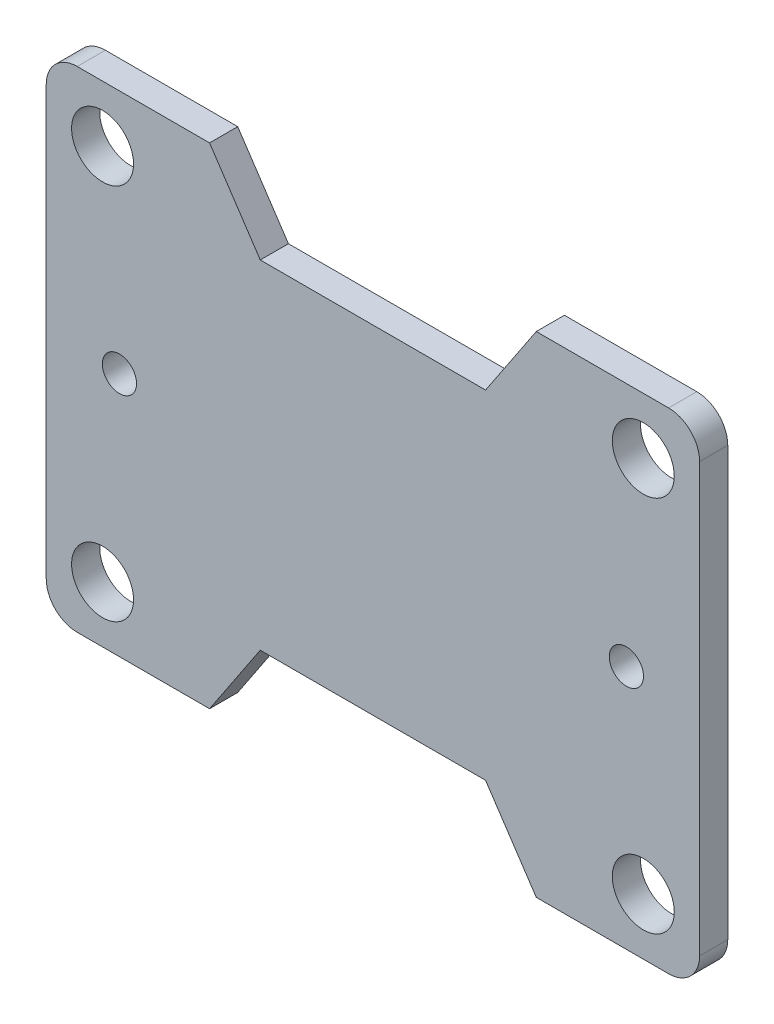
ISO-10303-21;
HEADER;
FILE_DESCRIPTION(('STEP AP214'),'2;1');
FILE_NAME('part.step','',(''),(''),'','','');
FILE_SCHEMA(('AUTOMOTIVE_DESIGN { 1 0 10303 214 1 1 1 1 }'));
ENDSEC;
DATA;
#1=APPLICATION_CONTEXT('core data for automotive mechanical design processes');
#2=APPLICATION_PROTOCOL_DEFINITION('international standard','automotive_design',2000,#1);
#3=PRODUCT_CONTEXT('',#1,'mechanical');
#4=PRODUCT('Part','Part','',(#3));
#5=PRODUCT_RELATED_PRODUCT_CATEGORY('part','',(#4));
#6=PRODUCT_DEFINITION_FORMATION('','',#4);
#7=PRODUCT_DEFINITION_CONTEXT('part definition',#1,'design');
#8=PRODUCT_DEFINITION('design','',#6,#7);
#9=PRODUCT_DEFINITION_SHAPE('','',#8);
#10=(LENGTH_UNIT() NAMED_UNIT(*) SI_UNIT(.MILLI.,.METRE.));
#11=(NAMED_UNIT(*) PLANE_ANGLE_UNIT() SI_UNIT($,.RADIAN.));
#12=(NAMED_UNIT(*) SI_UNIT($,.STERADIAN.) SOLID_ANGLE_UNIT());
#13=UNCERTAINTY_MEASURE_WITH_UNIT(LENGTH_MEASURE(1.E-05),#10,'distance_accuracy_value','');
#14=(GEOMETRIC_REPRESENTATION_CONTEXT(3) GLOBAL_UNCERTAINTY_ASSIGNED_CONTEXT((#13)) GLOBAL_UNIT_ASSIGNED_CONTEXT((#10,
#11,#12)) REPRESENTATION_CONTEXT('',''));
#15=CARTESIAN_POINT('',(0.,0.,0.));
#16=DIRECTION('',(0.,0.,1.));
#17=DIRECTION('',(1.,0.,0.));
#18=AXIS2_PLACEMENT_3D('',#15,#16,#17);
#19=CARTESIAN_POINT('',(53.,0.,2.5));
#20=DIRECTION('',(-1.,0.,0.));
#21=DIRECTION('',(0.,0.,1.));
#22=AXIS2_PLACEMENT_3D('',#19,#20,#21);
#23=PLANE('',#22);
#24=DIRECTION('',(0.,1.,0.));
#25=VECTOR('',#24,1.);
#26=CARTESIAN_POINT('',(53.,0.,0.));
#27=LINE('',#26,#25);
#28=CARTESIAN_POINT('',(53.,-2.25,0.));
#29=VERTEX_POINT('',#28);
#30=CARTESIAN_POINT('',(53.,35.75,0.));
#31=VERTEX_POINT('',#30);
#32=EDGE_CURVE('E222',#29,#31,#27,.T.);
#33=ORIENTED_EDGE('',*,*,#32,.T.);
#34=DIRECTION('',(0.,0.,-1.));
#35=VECTOR('',#34,1.);
#36=CARTESIAN_POINT('',(53.,35.75,2.5));
#37=LINE('',#36,#35);
#38=CARTESIAN_POINT('',(53.,35.75,2.5));
#39=VERTEX_POINT('',#38);
#40=EDGE_CURVE('E296',#31,#39,#37,.F.);
#41=ORIENTED_EDGE('',*,*,#40,.T.);
#42=DIRECTION('',(0.,1.,0.));
#43=VECTOR('',#42,1.);
#44=CARTESIAN_POINT('',(53.,0.,2.5));
#45=LINE('',#44,#43);
#46=CARTESIAN_POINT('',(53.,-2.25,2.5));
#47=VERTEX_POINT('',#46);
#48=EDGE_CURVE('E164',#47,#39,#45,.T.);
#49=ORIENTED_EDGE('',*,*,#48,.F.);
#50=DIRECTION('',(0.,0.,-1.));
#51=VECTOR('',#50,1.);
#52=CARTESIAN_POINT('',(53.,-2.25,2.5));
#53=LINE('',#52,#51);
#54=EDGE_CURVE('E293',#47,#29,#53,.T.);
#55=ORIENTED_EDGE('',*,*,#54,.T.);
#56=EDGE_LOOP('',(#33,#41,#49,#55));
#57=FACE_BOUND('',#56,.T.);
#58=ADVANCED_FACE('F37',(#57),#23,.F.);
#59=CARTESIAN_POINT('',(0.,38.5,2.5));
#60=DIRECTION('',(0.,-1.,0.));
#61=DIRECTION('',(0.,0.,-1.));
#62=AXIS2_PLACEMENT_3D('',#59,#60,#61);
#63=PLANE('',#62);
#64=DIRECTION('',(-1.,0.,0.));
#65=VECTOR('',#64,1.);
#66=CARTESIAN_POINT('',(0.,38.5,2.5));
#67=LINE('',#66,#65);
#68=CARTESIAN_POINT('',(50.25,38.5,2.5));
#69=VERTEX_POINT('',#68);
#70=CARTESIAN_POINT('',(38.5,38.5,2.5));
#71=VERTEX_POINT('',#70);
#72=EDGE_CURVE('E152',#69,#71,#67,.T.);
#73=ORIENTED_EDGE('',*,*,#72,.F.);
#74=DIRECTION('',(0.,0.,-1.));
#75=VECTOR('',#74,1.);
#76=CARTESIAN_POINT('',(50.25,38.5,2.5));
#77=LINE('',#76,#75);
#78=CARTESIAN_POINT('',(50.25,38.5,0.));
#79=VERTEX_POINT('',#78);
#80=EDGE_CURVE('E174',#69,#79,#77,.T.);
#81=ORIENTED_EDGE('',*,*,#80,.T.);
#82=DIRECTION('',(-1.,0.,0.));
#83=VECTOR('',#82,1.);
#84=CARTESIAN_POINT('',(0.,38.5,0.));
#85=LINE('',#84,#83);
#86=CARTESIAN_POINT('',(38.5,38.5,0.));
#87=VERTEX_POINT('',#86);
#88=EDGE_CURVE('E170',#79,#87,#85,.T.);
#89=ORIENTED_EDGE('',*,*,#88,.T.);
#90=DIRECTION('',(0.,0.,-1.));
#91=VECTOR('',#90,1.);
#92=CARTESIAN_POINT('',(38.5,38.5,2.5));
#93=LINE('',#92,#91);
#94=EDGE_CURVE('E167',#71,#87,#93,.T.);
#95=ORIENTED_EDGE('',*,*,#94,.F.);
#96=EDGE_LOOP('',(#73,#81,#89,#95));
#97=FACE_BOUND('',#96,.T.);
#98=ADVANCED_FACE('F168',(#97),#63,.F.);
#99=CARTESIAN_POINT('',(8.88461538461537,-5.92307692307692,2.5));
#100=DIRECTION('',(-0.832050294337844,0.554700196225229,0.));
#101=DIRECTION('',(-0.554700196225229,-0.832050294337844,0.));
#102=AXIS2_PLACEMENT_3D('',#99,#100,#101);
#103=PLANE('',#102);
#104=DIRECTION('',(0.554700196225229,0.832050294337844,0.));
#105=VECTOR('',#104,1.);
#106=CARTESIAN_POINT('',(8.88461538461537,-5.92307692307692,0.));
#107=LINE('',#106,#105);
#108=CARTESIAN_POINT('',(34.,31.75,0.));
#109=VERTEX_POINT('',#108);
#110=EDGE_CURVE('E226',#109,#87,#107,.T.);
#111=ORIENTED_EDGE('',*,*,#110,.F.);
#112=DIRECTION('',(0.,0.,-1.));
#113=VECTOR('',#112,1.);
#114=CARTESIAN_POINT('',(34.,31.75,2.5));
#115=LINE('',#114,#113);
#116=CARTESIAN_POINT('',(34.,31.75,2.5));
#117=VERTEX_POINT('',#116);
#118=EDGE_CURVE('E175',#117,#109,#115,.T.);
#119=ORIENTED_EDGE('',*,*,#118,.F.);
#120=DIRECTION('',(0.554700196225229,0.832050294337844,0.));
#121=VECTOR('',#120,1.);
#122=CARTESIAN_POINT('',(8.88461538461537,-5.92307692307692,2.5));
#123=LINE('',#122,#121);
#124=EDGE_CURVE('E158',#117,#71,#123,.T.);
#125=ORIENTED_EDGE('',*,*,#124,.T.);
#126=ORIENTED_EDGE('',*,*,#94,.T.);
#127=EDGE_LOOP('',(#111,#119,#125,#126));
#128=FACE_BOUND('',#127,.T.);
#129=ADVANCED_FACE('F177',(#128),#103,.T.);
#130=CARTESIAN_POINT('',(0.,31.75,2.5));
#131=DIRECTION('',(0.,-1.,0.));
#132=DIRECTION('',(0.,0.,-1.));
#133=AXIS2_PLACEMENT_3D('',#130,#131,#132);
#134=PLANE('',#133);
#135=DIRECTION('',(-1.,0.,0.));
#136=VECTOR('',#135,1.);
#137=CARTESIAN_POINT('',(0.,31.75,0.));
#138=LINE('',#137,#136);
#139=CARTESIAN_POINT('',(14.,31.75,0.));
#140=VERTEX_POINT('',#139);
#141=EDGE_CURVE('E228',#109,#140,#138,.T.);
#142=ORIENTED_EDGE('',*,*,#141,.T.);
#143=DIRECTION('',(0.,0.,-1.));
#144=VECTOR('',#143,1.);
#145=CARTESIAN_POINT('',(14.,31.75,2.5));
#146=LINE('',#145,#144);
#147=CARTESIAN_POINT('',(14.,31.75,2.5));
#148=VERTEX_POINT('',#147);
#149=EDGE_CURVE('E281',#148,#140,#146,.T.);
#150=ORIENTED_EDGE('',*,*,#149,.F.);
#151=DIRECTION('',(-1.,0.,0.));
#152=VECTOR('',#151,1.);
#153=CARTESIAN_POINT('',(0.,31.75,2.5));
#154=LINE('',#153,#152);
#155=EDGE_CURVE('E179',#117,#148,#154,.T.);
#156=ORIENTED_EDGE('',*,*,#155,.F.);
#157=ORIENTED_EDGE('',*,*,#118,.T.);
#158=EDGE_LOOP('',(#142,#150,#156,#157));
#159=FACE_BOUND('',#158,.T.);
#160=ADVANCED_FACE('F369',(#159),#134,.F.);
#161=CARTESIAN_POINT('',(24.3461538461538,16.2307692307693,2.5));
#162=DIRECTION('',(0.832050294337843,0.55470019622523,0.));
#163=DIRECTION('',(-0.55470019622523,0.832050294337843,0.));
#164=AXIS2_PLACEMENT_3D('',#161,#162,#163);
#165=PLANE('',#164);
#166=DIRECTION('',(0.55470019622523,-0.832050294337843,0.));
#167=VECTOR('',#166,1.);
#168=CARTESIAN_POINT('',(24.3461538461538,16.2307692307693,0.));
#169=LINE('',#168,#167);
#170=CARTESIAN_POINT('',(9.5,38.5,0.));
#171=VERTEX_POINT('',#170);
#172=EDGE_CURVE('E231',#171,#140,#169,.T.);
#173=ORIENTED_EDGE('',*,*,#172,.F.);
#174=DIRECTION('',(0.,0.,-1.));
#175=VECTOR('',#174,1.);
#176=CARTESIAN_POINT('',(9.5,38.5,2.5));
#177=LINE('',#176,#175);
#178=CARTESIAN_POINT('',(9.5,38.5,2.5));
#179=VERTEX_POINT('',#178);
#180=EDGE_CURVE('E278',#179,#171,#177,.T.);
#181=ORIENTED_EDGE('',*,*,#180,.F.);
#182=DIRECTION('',(0.55470019622523,-0.832050294337843,0.));
#183=VECTOR('',#182,1.);
#184=CARTESIAN_POINT('',(24.3461538461538,16.2307692307693,2.5));
#185=LINE('',#184,#183);
#186=EDGE_CURVE('E181',#179,#148,#185,.T.);
#187=ORIENTED_EDGE('',*,*,#186,.T.);
#188=ORIENTED_EDGE('',*,*,#149,.T.);
#189=EDGE_LOOP('',(#173,#181,#187,#188));
#190=FACE_BOUND('',#189,.T.);
#191=ADVANCED_FACE('F372',(#190),#165,.T.);
#192=CARTESIAN_POINT('',(0.,38.5,2.5));
#193=DIRECTION('',(0.,1.,0.));
#194=DIRECTION('',(0.,0.,1.));
#195=AXIS2_PLACEMENT_3D('',#192,#193,#194);
#196=PLANE('',#195);
#197=DIRECTION('',(1.,0.,0.));
#198=VECTOR('',#197,1.);
#199=CARTESIAN_POINT('',(0.,38.5,0.));
#200=LINE('',#199,#198);
#201=CARTESIAN_POINT('',(-2.25,38.5,0.));
#202=VERTEX_POINT('',#201);
#203=EDGE_CURVE('E234',#202,#171,#200,.T.);
#204=ORIENTED_EDGE('',*,*,#203,.F.);
#205=DIRECTION('',(0.,0.,-1.));
#206=VECTOR('',#205,1.);
#207=CARTESIAN_POINT('',(-2.25,38.5,2.5));
#208=LINE('',#207,#206);
#209=CARTESIAN_POINT('',(-2.25,38.5,2.5));
#210=VERTEX_POINT('',#209);
#211=EDGE_CURVE('E11',#202,#210,#208,.F.);
#212=ORIENTED_EDGE('',*,*,#211,.T.);
#213=DIRECTION('',(1.,0.,0.));
#214=VECTOR('',#213,1.);
#215=CARTESIAN_POINT('',(0.,38.5,2.5));
#216=LINE('',#215,#214);
#217=EDGE_CURVE('E187',#210,#179,#216,.T.);
#218=ORIENTED_EDGE('',*,*,#217,.T.);
#219=ORIENTED_EDGE('',*,*,#180,.T.);
#220=EDGE_LOOP('',(#204,#212,#218,#219));
#221=FACE_BOUND('',#220,.T.);
#222=ADVANCED_FACE('F376',(#221),#196,.T.);
#223=CARTESIAN_POINT('',(-5.,0.,2.5));
#224=DIRECTION('',(-1.,0.,0.));
#225=DIRECTION('',(0.,0.,1.));
#226=AXIS2_PLACEMENT_3D('',#223,#224,#225);
#227=PLANE('',#226);
#228=DIRECTION('',(0.,1.,0.));
#229=VECTOR('',#228,1.);
#230=CARTESIAN_POINT('',(-5.,0.,0.));
#231=LINE('',#230,#229);
#232=CARTESIAN_POINT('',(-5.,-2.25,0.));
#233=VERTEX_POINT('',#232);
#234=CARTESIAN_POINT('',(-5.,35.75,0.));
#235=VERTEX_POINT('',#234);
#236=EDGE_CURVE('E236',#233,#235,#231,.T.);
#237=ORIENTED_EDGE('',*,*,#236,.F.);
#238=DIRECTION('',(0.,0.,-1.));
#239=VECTOR('',#238,1.);
#240=CARTESIAN_POINT('',(-5.,-2.25,2.5));
#241=LINE('',#240,#239);
#242=CARTESIAN_POINT('',(-5.,-2.25,2.5));
#243=VERTEX_POINT('',#242);
#244=EDGE_CURVE('E45',#233,#243,#241,.F.);
#245=ORIENTED_EDGE('',*,*,#244,.T.);
#246=DIRECTION('',(0.,1.,0.));
#247=VECTOR('',#246,1.);
#248=CARTESIAN_POINT('',(-5.,0.,2.5));
#249=LINE('',#248,#247);
#250=CARTESIAN_POINT('',(-5.,35.75,2.5));
#251=VERTEX_POINT('',#250);
#252=EDGE_CURVE('E189',#243,#251,#249,.T.);
#253=ORIENTED_EDGE('',*,*,#252,.T.);
#254=DIRECTION('',(0.,0.,-1.));
#255=VECTOR('',#254,1.);
#256=CARTESIAN_POINT('',(-5.,35.75,2.5));
#257=LINE('',#256,#255);
#258=EDGE_CURVE('E308',#251,#235,#257,.T.);
#259=ORIENTED_EDGE('',*,*,#258,.T.);
#260=EDGE_LOOP('',(#237,#245,#253,#259));
#261=FACE_BOUND('',#260,.T.);
#262=ADVANCED_FACE('F313',(#261),#227,.T.);
#263=CARTESIAN_POINT('',(0.,-5.,2.5));
#264=DIRECTION('',(0.,-1.,0.));
#265=DIRECTION('',(0.,0.,-1.));
#266=AXIS2_PLACEMENT_3D('',#263,#264,#265);
#267=PLANE('',#266);
#268=DIRECTION('',(-1.,0.,0.));
#269=VECTOR('',#268,1.);
#270=CARTESIAN_POINT('',(0.,-5.,2.5));
#271=LINE('',#270,#269);
#272=CARTESIAN_POINT('',(9.5,-5.,2.5));
#273=VERTEX_POINT('',#272);
#274=CARTESIAN_POINT('',(-2.25,-5.,2.5));
#275=VERTEX_POINT('',#274);
#276=EDGE_CURVE('E192',#273,#275,#271,.T.);
#277=ORIENTED_EDGE('',*,*,#276,.T.);
#278=DIRECTION('',(0.,0.,-1.));
#279=VECTOR('',#278,1.);
#280=CARTESIAN_POINT('',(-2.25,-5.,2.5));
#281=LINE('',#280,#279);
#282=CARTESIAN_POINT('',(-2.25,-5.,0.));
#283=VERTEX_POINT('',#282);
#284=EDGE_CURVE('E305',#275,#283,#281,.T.);
#285=ORIENTED_EDGE('',*,*,#284,.T.);
#286=DIRECTION('',(-1.,0.,0.));
#287=VECTOR('',#286,1.);
#288=CARTESIAN_POINT('',(0.,-5.,0.));
#289=LINE('',#288,#287);
#290=CARTESIAN_POINT('',(9.5,-5.,0.));
#291=VERTEX_POINT('',#290);
#292=EDGE_CURVE('E239',#291,#283,#289,.T.);
#293=ORIENTED_EDGE('',*,*,#292,.F.);
#294=DIRECTION('',(0.,0.,-1.));
#295=VECTOR('',#294,1.);
#296=CARTESIAN_POINT('',(9.5,-5.,2.5));
#297=LINE('',#296,#295);
#298=EDGE_CURVE('E276',#273,#291,#297,.T.);
#299=ORIENTED_EDGE('',*,*,#298,.F.);
#300=EDGE_LOOP('',(#277,#285,#293,#299));
#301=FACE_BOUND('',#300,.T.);
#302=ADVANCED_FACE('F322',(#301),#267,.T.);
#303=CARTESIAN_POINT('',(8.88461538461539,-5.92307692307692,2.5));
#304=DIRECTION('',(-0.832050294337844,0.554700196225229,0.));
#305=DIRECTION('',(-0.554700196225229,-0.832050294337844,0.));
#306=AXIS2_PLACEMENT_3D('',#303,#304,#305);
#307=PLANE('',#306);
#308=DIRECTION('',(0.554700196225229,0.832050294337844,0.));
#309=VECTOR('',#308,1.);
#310=CARTESIAN_POINT('',(8.88461538461539,-5.92307692307692,0.));
#311=LINE('',#310,#309);
#312=CARTESIAN_POINT('',(14.,1.75,0.));
#313=VERTEX_POINT('',#312);
#314=EDGE_CURVE('E242',#291,#313,#311,.T.);
#315=ORIENTED_EDGE('',*,*,#314,.T.);
#316=DIRECTION('',(0.,0.,-1.));
#317=VECTOR('',#316,1.);
#318=CARTESIAN_POINT('',(14.,1.75,2.5));
#319=LINE('',#318,#317);
#320=CARTESIAN_POINT('',(14.,1.75,2.5));
#321=VERTEX_POINT('',#320);
#322=EDGE_CURVE('E274',#321,#313,#319,.T.);
#323=ORIENTED_EDGE('',*,*,#322,.F.);
#324=DIRECTION('',(0.554700196225229,0.832050294337844,0.));
#325=VECTOR('',#324,1.);
#326=CARTESIAN_POINT('',(8.88461538461539,-5.92307692307692,2.5));
#327=LINE('',#326,#325);
#328=EDGE_CURVE('E194',#273,#321,#327,.T.);
#329=ORIENTED_EDGE('',*,*,#328,.F.);
#330=ORIENTED_EDGE('',*,*,#298,.T.);
#331=EDGE_LOOP('',(#315,#323,#329,#330));
#332=FACE_BOUND('',#331,.T.);
#333=ADVANCED_FACE('F331',(#332),#307,.F.);
#334=CARTESIAN_POINT('',(0.,1.75,2.5));
#335=DIRECTION('',(0.,-1.,0.));
#336=DIRECTION('',(0.,0.,-1.));
#337=AXIS2_PLACEMENT_3D('',#334,#335,#336);
#338=PLANE('',#337);
#339=DIRECTION('',(-1.,0.,0.));
#340=VECTOR('',#339,1.);
#341=CARTESIAN_POINT('',(0.,1.75,0.));
#342=LINE('',#341,#340);
#343=CARTESIAN_POINT('',(34.,1.75,0.));
#344=VERTEX_POINT('',#343);
#345=EDGE_CURVE('E245',#344,#313,#342,.T.);
#346=ORIENTED_EDGE('',*,*,#345,.F.);
#347=DIRECTION('',(0.,0.,-1.));
#348=VECTOR('',#347,1.);
#349=CARTESIAN_POINT('',(34.,1.75,2.5));
#350=LINE('',#349,#348);
#351=CARTESIAN_POINT('',(34.,1.75,2.5));
#352=VERTEX_POINT('',#351);
#353=EDGE_CURVE('E272',#352,#344,#350,.T.);
#354=ORIENTED_EDGE('',*,*,#353,.F.);
#355=DIRECTION('',(-1.,0.,0.));
#356=VECTOR('',#355,1.);
#357=CARTESIAN_POINT('',(0.,1.75,2.5));
#358=LINE('',#357,#356);
#359=EDGE_CURVE('E196',#352,#321,#358,.T.);
#360=ORIENTED_EDGE('',*,*,#359,.T.);
#361=ORIENTED_EDGE('',*,*,#322,.T.);
#362=EDGE_LOOP('',(#346,#354,#360,#361));
#363=FACE_BOUND('',#362,.T.);
#364=ADVANCED_FACE('F337',(#363),#338,.T.);
#365=CARTESIAN_POINT('',(24.3461538461539,16.2307692307692,2.5));
#366=DIRECTION('',(0.832050294337844,0.554700196225229,0.));
#367=DIRECTION('',(-0.554700196225229,0.832050294337844,0.));
#368=AXIS2_PLACEMENT_3D('',#365,#366,#367);
#369=PLANE('',#368);
#370=DIRECTION('',(0.554700196225229,-0.832050294337844,0.));
#371=VECTOR('',#370,1.);
#372=CARTESIAN_POINT('',(24.3461538461539,16.2307692307692,0.));
#373=LINE('',#372,#371);
#374=CARTESIAN_POINT('',(38.5,-5.,0.));
#375=VERTEX_POINT('',#374);
#376=EDGE_CURVE('E248',#344,#375,#373,.T.);
#377=ORIENTED_EDGE('',*,*,#376,.T.);
#378=DIRECTION('',(0.,0.,-1.));
#379=VECTOR('',#378,1.);
#380=CARTESIAN_POINT('',(38.5,-5.,2.5));
#381=LINE('',#380,#379);
#382=CARTESIAN_POINT('',(38.5,-5.,2.5));
#383=VERTEX_POINT('',#382);
#384=EDGE_CURVE('E221',#383,#375,#381,.T.);
#385=ORIENTED_EDGE('',*,*,#384,.F.);
#386=DIRECTION('',(0.554700196225229,-0.832050294337844,0.));
#387=VECTOR('',#386,1.);
#388=CARTESIAN_POINT('',(24.3461538461539,16.2307692307692,2.5));
#389=LINE('',#388,#387);
#390=EDGE_CURVE('E199',#352,#383,#389,.T.);
#391=ORIENTED_EDGE('',*,*,#390,.F.);
#392=ORIENTED_EDGE('',*,*,#353,.T.);
#393=EDGE_LOOP('',(#377,#385,#391,#392));
#394=FACE_BOUND('',#393,.T.);
#395=ADVANCED_FACE('F339',(#394),#369,.F.);
#396=CARTESIAN_POINT('',(1.5,16.75,2.5));
#397=DIRECTION('',(0.,0.,-1.));
#398=DIRECTION('',(-1.,0.,0.));
#399=AXIS2_PLACEMENT_3D('',#396,#397,#398);
#400=CYLINDRICAL_SURFACE('',#399,1.52);
#401=CARTESIAN_POINT('',(1.5,16.75,2.5));
#402=DIRECTION('',(0.,0.,1.));
#403=DIRECTION('',(1.,0.,0.));
#404=AXIS2_PLACEMENT_3D('',#401,#402,#403);
#405=CIRCLE('',#404,1.52);
#406=CARTESIAN_POINT('',(3.02,16.75,2.5));
#407=VERTEX_POINT('',#406);
#408=EDGE_CURVE('E215',#407,#407,#405,.T.);
#409=ORIENTED_EDGE('',*,*,#408,.T.);
#410=EDGE_LOOP('',(#409));
#411=FACE_BOUND('',#410,.T.);
#412=CARTESIAN_POINT('',(1.5,16.75,0.));
#413=DIRECTION('',(0.,0.,1.));
#414=DIRECTION('',(1.,0.,0.));
#415=AXIS2_PLACEMENT_3D('',#412,#413,#414);
#416=CIRCLE('',#415,1.52);
#417=CARTESIAN_POINT('',(3.02,16.75,0.));
#418=VERTEX_POINT('',#417);
#419=EDGE_CURVE('E264',#418,#418,#416,.T.);
#420=ORIENTED_EDGE('',*,*,#419,.F.);
#421=EDGE_LOOP('',(#420));
#422=FACE_BOUND('',#421,.T.);
#423=ADVANCED_FACE('F391',(#411,#422),#400,.F.);
#424=CARTESIAN_POINT('',(0.,33.5,2.5));
#425=DIRECTION('',(0.,0.,-1.));
#426=DIRECTION('',(-1.,0.,0.));
#427=AXIS2_PLACEMENT_3D('',#424,#425,#426);
#428=CYLINDRICAL_SURFACE('',#427,2.74999999999999);
#429=CARTESIAN_POINT('',(0.,33.5,2.5));
#430=DIRECTION('',(0.,0.,1.));
#431=DIRECTION('',(1.,0.,0.));
#432=AXIS2_PLACEMENT_3D('',#429,#430,#431);
#433=CIRCLE('',#432,2.74999999999999);
#434=CARTESIAN_POINT('',(2.74999999999999,33.5,2.5));
#435=VERTEX_POINT('',#434);
#436=EDGE_CURVE('E212',#435,#435,#433,.T.);
#437=ORIENTED_EDGE('',*,*,#436,.T.);
#438=EDGE_LOOP('',(#437));
#439=FACE_BOUND('',#438,.T.);
#440=CARTESIAN_POINT('',(0.,33.5,0.));
#441=DIRECTION('',(0.,0.,1.));
#442=DIRECTION('',(1.,0.,0.));
#443=AXIS2_PLACEMENT_3D('',#440,#441,#442);
#444=CIRCLE('',#443,2.74999999999999);
#445=CARTESIAN_POINT('',(2.74999999999999,33.5,0.));
#446=VERTEX_POINT('',#445);
#447=EDGE_CURVE('E261',#446,#446,#444,.T.);
#448=ORIENTED_EDGE('',*,*,#447,.F.);
#449=EDGE_LOOP('',(#448));
#450=FACE_BOUND('',#449,.T.);
#451=ADVANCED_FACE('F406',(#439,#450),#428,.F.);
#452=CARTESIAN_POINT('',(48.,0.,2.5));
#453=DIRECTION('',(0.,0.,-1.));
#454=DIRECTION('',(-1.,0.,0.));
#455=AXIS2_PLACEMENT_3D('',#452,#453,#454);
#456=CYLINDRICAL_SURFACE('',#455,2.75);
#457=CARTESIAN_POINT('',(48.,0.,2.5));
#458=DIRECTION('',(0.,0.,1.));
#459=DIRECTION('',(1.,0.,0.));
#460=AXIS2_PLACEMENT_3D('',#457,#458,#459);
#461=CIRCLE('',#460,2.75);
#462=CARTESIAN_POINT('',(50.75,0.,2.5));
#463=VERTEX_POINT('',#462);
#464=EDGE_CURVE('E209',#463,#463,#461,.T.);
#465=ORIENTED_EDGE('',*,*,#464,.T.);
#466=EDGE_LOOP('',(#465));
#467=FACE_BOUND('',#466,.T.);
#468=CARTESIAN_POINT('',(48.,0.,0.));
#469=DIRECTION('',(0.,0.,1.));
#470=DIRECTION('',(1.,0.,0.));
#471=AXIS2_PLACEMENT_3D('',#468,#469,#470);
#472=CIRCLE('',#471,2.75);
#473=CARTESIAN_POINT('',(50.75,0.,0.));
#474=VERTEX_POINT('',#473);
#475=EDGE_CURVE('E258',#474,#474,#472,.T.);
#476=ORIENTED_EDGE('',*,*,#475,.F.);
#477=EDGE_LOOP('',(#476));
#478=FACE_BOUND('',#477,.T.);
#479=ADVANCED_FACE('F402',(#467,#478),#456,.F.);
#480=CARTESIAN_POINT('',(46.5,16.75,2.5));
#481=DIRECTION('',(0.,0.,-1.));
#482=DIRECTION('',(-1.,0.,0.));
#483=AXIS2_PLACEMENT_3D('',#480,#481,#482);
#484=CYLINDRICAL_SURFACE('',#483,1.52);
#485=CARTESIAN_POINT('',(46.5,16.75,2.5));
#486=DIRECTION('',(0.,0.,1.));
#487=DIRECTION('',(1.,0.,0.));
#488=AXIS2_PLACEMENT_3D('',#485,#486,#487);
#489=CIRCLE('',#488,1.52);
#490=CARTESIAN_POINT('',(48.02,16.75,2.5));
#491=VERTEX_POINT('',#490);
#492=EDGE_CURVE('E206',#491,#491,#489,.T.);
#493=ORIENTED_EDGE('',*,*,#492,.T.);
#494=EDGE_LOOP('',(#493));
#495=FACE_BOUND('',#494,.T.);
#496=CARTESIAN_POINT('',(46.5,16.75,0.));
#497=DIRECTION('',(0.,0.,1.));
#498=DIRECTION('',(1.,0.,0.));
#499=AXIS2_PLACEMENT_3D('',#496,#497,#498);
#500=CIRCLE('',#499,1.52);
#501=CARTESIAN_POINT('',(48.02,16.75,0.));
#502=VERTEX_POINT('',#501);
#503=EDGE_CURVE('E255',#502,#502,#500,.T.);
#504=ORIENTED_EDGE('',*,*,#503,.F.);
#505=EDGE_LOOP('',(#504));
#506=FACE_BOUND('',#505,.T.);
#507=ADVANCED_FACE('F398',(#495,#506),#484,.F.);
#508=CARTESIAN_POINT('',(48.,33.5,2.5));
#509=DIRECTION('',(0.,0.,-1.));
#510=DIRECTION('',(-1.,0.,0.));
#511=AXIS2_PLACEMENT_3D('',#508,#509,#510);
#512=CYLINDRICAL_SURFACE('',#511,2.75);
#513=CARTESIAN_POINT('',(48.,33.5,2.5));
#514=DIRECTION('',(0.,0.,1.));
#515=DIRECTION('',(1.,0.,0.));
#516=AXIS2_PLACEMENT_3D('',#513,#514,#515);
#517=CIRCLE('',#516,2.75);
#518=CARTESIAN_POINT('',(50.75,33.5,2.5));
#519=VERTEX_POINT('',#518);
#520=EDGE_CURVE('E203',#519,#519,#517,.T.);
#521=ORIENTED_EDGE('',*,*,#520,.T.);
#522=EDGE_LOOP('',(#521));
#523=FACE_BOUND('',#522,.T.);
#524=CARTESIAN_POINT('',(48.,33.5,0.));
#525=DIRECTION('',(0.,0.,1.));
#526=DIRECTION('',(1.,0.,0.));
#527=AXIS2_PLACEMENT_3D('',#524,#525,#526);
#528=CIRCLE('',#527,2.75);
#529=CARTESIAN_POINT('',(50.75,33.5,0.));
#530=VERTEX_POINT('',#529);
#531=EDGE_CURVE('E252',#530,#530,#528,.T.);
#532=ORIENTED_EDGE('',*,*,#531,.F.);
#533=EDGE_LOOP('',(#532));
#534=FACE_BOUND('',#533,.T.);
#535=ADVANCED_FACE('F395',(#523,#534),#512,.F.);
#536=CARTESIAN_POINT('',(0.,-5.,2.5));
#537=DIRECTION('',(0.,1.,0.));
#538=DIRECTION('',(0.,0.,1.));
#539=AXIS2_PLACEMENT_3D('',#536,#537,#538);
#540=PLANE('',#539);
#541=DIRECTION('',(1.,0.,0.));
#542=VECTOR('',#541,1.);
#543=CARTESIAN_POINT('',(0.,-5.,0.));
#544=LINE('',#543,#542);
#545=CARTESIAN_POINT('',(50.25,-5.,0.));
#546=VERTEX_POINT('',#545);
#547=EDGE_CURVE('E250',#375,#546,#544,.T.);
#548=ORIENTED_EDGE('',*,*,#547,.T.);
#549=DIRECTION('',(0.,0.,-1.));
#550=VECTOR('',#549,1.);
#551=CARTESIAN_POINT('',(50.25,-5.,2.5));
#552=LINE('',#551,#550);
#553=CARTESIAN_POINT('',(50.25,-5.,2.5));
#554=VERTEX_POINT('',#553);
#555=EDGE_CURVE('E52',#546,#554,#552,.F.);
#556=ORIENTED_EDGE('',*,*,#555,.T.);
#557=DIRECTION('',(1.,0.,0.));
#558=VECTOR('',#557,1.);
#559=CARTESIAN_POINT('',(0.,-5.,2.5));
#560=LINE('',#559,#558);
#561=EDGE_CURVE('E201',#383,#554,#560,.T.);
#562=ORIENTED_EDGE('',*,*,#561,.F.);
#563=ORIENTED_EDGE('',*,*,#384,.T.);
#564=EDGE_LOOP('',(#548,#556,#562,#563));
#565=FACE_BOUND('',#564,.T.);
#566=ADVANCED_FACE('F341',(#565),#540,.F.);
#567=CARTESIAN_POINT('',(0.,0.,2.5));
#568=DIRECTION('',(0.,0.,-1.));
#569=DIRECTION('',(-1.,0.,0.));
#570=AXIS2_PLACEMENT_3D('',#567,#568,#569);
#571=CYLINDRICAL_SURFACE('',#570,2.75);
#572=CARTESIAN_POINT('',(0.,0.,2.5));
#573=DIRECTION('',(0.,0.,1.));
#574=DIRECTION('',(1.,0.,0.));
#575=AXIS2_PLACEMENT_3D('',#572,#573,#574);
#576=CIRCLE('',#575,2.75);
#577=CARTESIAN_POINT('',(2.75,0.,2.5));
#578=VERTEX_POINT('',#577);
#579=EDGE_CURVE('E218',#578,#578,#576,.T.);
#580=ORIENTED_EDGE('',*,*,#579,.T.);
#581=EDGE_LOOP('',(#580));
#582=FACE_BOUND('',#581,.T.);
#583=CARTESIAN_POINT('',(0.,0.,0.));
#584=DIRECTION('',(0.,0.,1.));
#585=DIRECTION('',(1.,0.,0.));
#586=AXIS2_PLACEMENT_3D('',#583,#584,#585);
#587=CIRCLE('',#586,2.75);
#588=CARTESIAN_POINT('',(2.75,0.,0.));
#589=VERTEX_POINT('',#588);
#590=EDGE_CURVE('E267',#589,#589,#587,.T.);
#591=ORIENTED_EDGE('',*,*,#590,.F.);
#592=EDGE_LOOP('',(#591));
#593=FACE_BOUND('',#592,.T.);
#594=ADVANCED_FACE('F394',(#582,#593),#571,.F.);
#595=CARTESIAN_POINT('',(0.,0.,2.5));
#596=DIRECTION('',(0.,0.,1.));
#597=DIRECTION('',(1.,0.,0.));
#598=AXIS2_PLACEMENT_3D('',#595,#596,#597);
#599=PLANE('',#598);
#600=ORIENTED_EDGE('',*,*,#48,.T.);
#601=CARTESIAN_POINT('',(50.25,35.75,2.5));
#602=DIRECTION('',(0.,0.,1.));
#603=DIRECTION('',(1.,0.,0.));
#604=AXIS2_PLACEMENT_3D('',#601,#602,#603);
#605=CIRCLE('',#604,2.75);
#606=EDGE_CURVE('E160',#39,#69,#605,.T.);
#607=ORIENTED_EDGE('',*,*,#606,.T.);
#608=ORIENTED_EDGE('',*,*,#72,.T.);
#609=ORIENTED_EDGE('',*,*,#124,.F.);
#610=ORIENTED_EDGE('',*,*,#155,.T.);
#611=ORIENTED_EDGE('',*,*,#186,.F.);
#612=ORIENTED_EDGE('',*,*,#217,.F.);
#613=CARTESIAN_POINT('',(-2.25,35.75,2.5));
#614=DIRECTION('',(0.,0.,1.));
#615=DIRECTION('',(1.,0.,0.));
#616=AXIS2_PLACEMENT_3D('',#613,#614,#615);
#617=CIRCLE('',#616,2.75);
#618=EDGE_CURVE('E298',#210,#251,#617,.T.);
#619=ORIENTED_EDGE('',*,*,#618,.T.);
#620=ORIENTED_EDGE('',*,*,#252,.F.);
#621=CARTESIAN_POINT('',(-2.25,-2.25,2.5));
#622=DIRECTION('',(0.,0.,1.));
#623=DIRECTION('',(1.,0.,0.));
#624=AXIS2_PLACEMENT_3D('',#621,#622,#623);
#625=CIRCLE('',#624,2.75);
#626=EDGE_CURVE('E60',#243,#275,#625,.T.);
#627=ORIENTED_EDGE('',*,*,#626,.T.);
#628=ORIENTED_EDGE('',*,*,#276,.F.);
#629=ORIENTED_EDGE('',*,*,#328,.T.);
#630=ORIENTED_EDGE('',*,*,#359,.F.);
#631=ORIENTED_EDGE('',*,*,#390,.T.);
#632=ORIENTED_EDGE('',*,*,#561,.T.);
#633=CARTESIAN_POINT('',(50.25,-2.25,2.5));
#634=DIRECTION('',(0.,0.,1.));
#635=DIRECTION('',(1.,0.,0.));
#636=AXIS2_PLACEMENT_3D('',#633,#634,#635);
#637=CIRCLE('',#636,2.75);
#638=EDGE_CURVE('E301',#554,#47,#637,.T.);
#639=ORIENTED_EDGE('',*,*,#638,.T.);
#640=EDGE_LOOP('',(#600,#607,#608,#609,#610,#611,#612,#619,#620,#627,#628,#629,#630,#631,#632,#639));
#641=FACE_BOUND('',#640,.T.);
#642=ORIENTED_EDGE('',*,*,#520,.F.);
#643=EDGE_LOOP('',(#642));
#644=FACE_BOUND('',#643,.T.);
#645=ORIENTED_EDGE('',*,*,#492,.F.);
#646=EDGE_LOOP('',(#645));
#647=FACE_BOUND('',#646,.T.);
#648=ORIENTED_EDGE('',*,*,#464,.F.);
#649=EDGE_LOOP('',(#648));
#650=FACE_BOUND('',#649,.T.);
#651=ORIENTED_EDGE('',*,*,#436,.F.);
#652=EDGE_LOOP('',(#651));
#653=FACE_BOUND('',#652,.T.);
#654=ORIENTED_EDGE('',*,*,#408,.F.);
#655=EDGE_LOOP('',(#654));
#656=FACE_BOUND('',#655,.T.);
#657=ORIENTED_EDGE('',*,*,#579,.F.);
#658=EDGE_LOOP('',(#657));
#659=FACE_BOUND('',#658,.T.);
#660=ADVANCED_FACE('F155',(#641,#644,#647,#650,#653,#656,#659),#599,.T.);
#661=CARTESIAN_POINT('',(0.,0.,0.));
#662=DIRECTION('',(0.,0.,1.));
#663=DIRECTION('',(1.,0.,0.));
#664=AXIS2_PLACEMENT_3D('',#661,#662,#663);
#665=PLANE('',#664);
#666=ORIENTED_EDGE('',*,*,#88,.F.);
#667=CARTESIAN_POINT('',(50.25,35.75,0.));
#668=DIRECTION('',(0.,0.,1.));
#669=DIRECTION('',(1.,0.,0.));
#670=AXIS2_PLACEMENT_3D('',#667,#668,#669);
#671=CIRCLE('',#670,2.75);
#672=EDGE_CURVE('E291',#79,#31,#671,.F.);
#673=ORIENTED_EDGE('',*,*,#672,.T.);
#674=ORIENTED_EDGE('',*,*,#32,.F.);
#675=CARTESIAN_POINT('',(50.25,-2.25,0.));
#676=DIRECTION('',(0.,0.,1.));
#677=DIRECTION('',(1.,0.,0.));
#678=AXIS2_PLACEMENT_3D('',#675,#676,#677);
#679=CIRCLE('',#678,2.75);
#680=EDGE_CURVE('E289',#29,#546,#679,.F.);
#681=ORIENTED_EDGE('',*,*,#680,.T.);
#682=ORIENTED_EDGE('',*,*,#547,.F.);
#683=ORIENTED_EDGE('',*,*,#376,.F.);
#684=ORIENTED_EDGE('',*,*,#345,.T.);
#685=ORIENTED_EDGE('',*,*,#314,.F.);
#686=ORIENTED_EDGE('',*,*,#292,.T.);
#687=CARTESIAN_POINT('',(-2.25,-2.25,0.));
#688=DIRECTION('',(0.,0.,1.));
#689=DIRECTION('',(1.,0.,0.));
#690=AXIS2_PLACEMENT_3D('',#687,#688,#689);
#691=CIRCLE('',#690,2.75);
#692=EDGE_CURVE('E287',#283,#233,#691,.F.);
#693=ORIENTED_EDGE('',*,*,#692,.T.);
#694=ORIENTED_EDGE('',*,*,#236,.T.);
#695=CARTESIAN_POINT('',(-2.25,35.75,0.));
#696=DIRECTION('',(0.,0.,1.));
#697=DIRECTION('',(1.,0.,0.));
#698=AXIS2_PLACEMENT_3D('',#695,#696,#697);
#699=CIRCLE('',#698,2.75);
#700=EDGE_CURVE('E285',#235,#202,#699,.F.);
#701=ORIENTED_EDGE('',*,*,#700,.T.);
#702=ORIENTED_EDGE('',*,*,#203,.T.);
#703=ORIENTED_EDGE('',*,*,#172,.T.);
#704=ORIENTED_EDGE('',*,*,#141,.F.);
#705=ORIENTED_EDGE('',*,*,#110,.T.);
#706=EDGE_LOOP('',(#666,#673,#674,#681,#682,#683,#684,#685,#686,#693,#694,#701,#702,#703,#704,#705));
#707=FACE_BOUND('',#706,.T.);
#708=ORIENTED_EDGE('',*,*,#531,.T.);
#709=EDGE_LOOP('',(#708));
#710=FACE_BOUND('',#709,.T.);
#711=ORIENTED_EDGE('',*,*,#503,.T.);
#712=EDGE_LOOP('',(#711));
#713=FACE_BOUND('',#712,.T.);
#714=ORIENTED_EDGE('',*,*,#475,.T.);
#715=EDGE_LOOP('',(#714));
#716=FACE_BOUND('',#715,.T.);
#717=ORIENTED_EDGE('',*,*,#447,.T.);
#718=EDGE_LOOP('',(#717));
#719=FACE_BOUND('',#718,.T.);
#720=ORIENTED_EDGE('',*,*,#419,.T.);
#721=EDGE_LOOP('',(#720));
#722=FACE_BOUND('',#721,.T.);
#723=ORIENTED_EDGE('',*,*,#590,.T.);
#724=EDGE_LOOP('',(#723));
#725=FACE_BOUND('',#724,.T.);
#726=ADVANCED_FACE('F325',(#707,#710,#713,#716,#719,#722,#725),#665,.F.);
#727=CARTESIAN_POINT('',(50.25,35.75,2.5));
#728=DIRECTION('',(0.,0.,-1.));
#729=DIRECTION('',(-1.,0.,0.));
#730=AXIS2_PLACEMENT_3D('',#727,#728,#729);
#731=CYLINDRICAL_SURFACE('',#730,2.75);
#732=ORIENTED_EDGE('',*,*,#606,.F.);
#733=ORIENTED_EDGE('',*,*,#40,.F.);
#734=ORIENTED_EDGE('',*,*,#672,.F.);
#735=ORIENTED_EDGE('',*,*,#80,.F.);
#736=EDGE_LOOP('',(#732,#733,#734,#735));
#737=FACE_BOUND('',#736,.T.);
#738=ADVANCED_FACE('F351',(#737),#731,.T.);
#739=CARTESIAN_POINT('',(50.25,-2.25,2.5));
#740=DIRECTION('',(0.,0.,-1.));
#741=DIRECTION('',(-1.,0.,0.));
#742=AXIS2_PLACEMENT_3D('',#739,#740,#741);
#743=CYLINDRICAL_SURFACE('',#742,2.75);
#744=ORIENTED_EDGE('',*,*,#638,.F.);
#745=ORIENTED_EDGE('',*,*,#555,.F.);
#746=ORIENTED_EDGE('',*,*,#680,.F.);
#747=ORIENTED_EDGE('',*,*,#54,.F.);
#748=EDGE_LOOP('',(#744,#745,#746,#747));
#749=FACE_BOUND('',#748,.T.);
#750=ADVANCED_FACE('F346',(#749),#743,.T.);
#751=CARTESIAN_POINT('',(-2.25,-2.25,2.5));
#752=DIRECTION('',(0.,0.,-1.));
#753=DIRECTION('',(-1.,0.,0.));
#754=AXIS2_PLACEMENT_3D('',#751,#752,#753);
#755=CYLINDRICAL_SURFACE('',#754,2.75);
#756=ORIENTED_EDGE('',*,*,#626,.F.);
#757=ORIENTED_EDGE('',*,*,#244,.F.);
#758=ORIENTED_EDGE('',*,*,#692,.F.);
#759=ORIENTED_EDGE('',*,*,#284,.F.);
#760=EDGE_LOOP('',(#756,#757,#758,#759));
#761=FACE_BOUND('',#760,.T.);
#762=ADVANCED_FACE('F319',(#761),#755,.T.);
#763=CARTESIAN_POINT('',(-2.25,35.75,2.5));
#764=DIRECTION('',(0.,0.,-1.));
#765=DIRECTION('',(-1.,0.,0.));
#766=AXIS2_PLACEMENT_3D('',#763,#764,#765);
#767=CYLINDRICAL_SURFACE('',#766,2.75);
#768=ORIENTED_EDGE('',*,*,#618,.F.);
#769=ORIENTED_EDGE('',*,*,#211,.F.);
#770=ORIENTED_EDGE('',*,*,#700,.F.);
#771=ORIENTED_EDGE('',*,*,#258,.F.);
#772=EDGE_LOOP('',(#768,#769,#770,#771));
#773=FACE_BOUND('',#772,.T.);
#774=ADVANCED_FACE('F39',(#773),#767,.T.);
#775=CLOSED_SHELL('',(#58,#98,#129,#160,#191,#222,#262,#302,#333,#364,#395,#423,#451,#479,#507,
#535,#566,#594,#660,#726,#738,#750,#762,#774));
#776=MANIFOLD_SOLID_BREP('B2',#775);
#777=ADVANCED_BREP_SHAPE_REPRESENTATION('',(#18,#776),#14);
#778=SHAPE_DEFINITION_REPRESENTATION(#9,#777);
ENDSEC;
END-ISO-10303-21;
